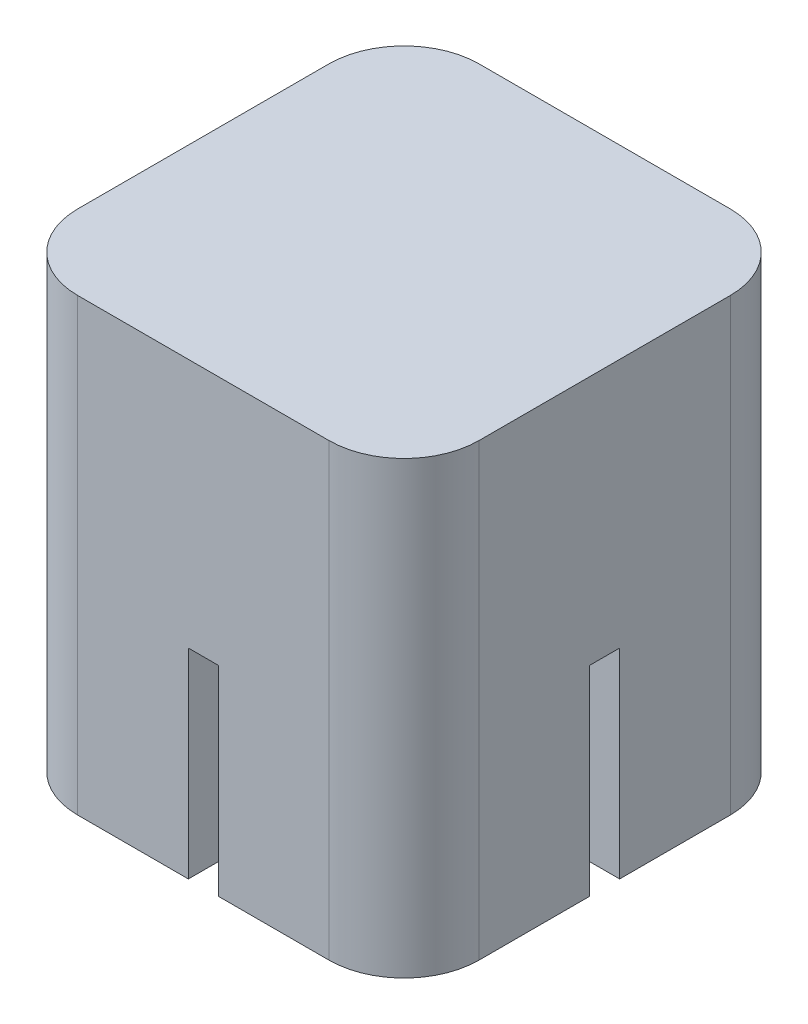
ISO-10303-21;
HEADER;
FILE_DESCRIPTION(('STEP AP214'),'2;1');
FILE_NAME('part.step','',(''),(''),'','','');
FILE_SCHEMA(('AUTOMOTIVE_DESIGN { 1 0 10303 214 1 1 1 1 }'));
ENDSEC;
DATA;
#1=APPLICATION_CONTEXT('core data for automotive mechanical design processes');
#2=APPLICATION_PROTOCOL_DEFINITION('international standard','automotive_design',2000,#1);
#3=PRODUCT_CONTEXT('',#1,'mechanical');
#4=PRODUCT('Part','Part','',(#3));
#5=PRODUCT_RELATED_PRODUCT_CATEGORY('part','',(#4));
#6=PRODUCT_DEFINITION_FORMATION('','',#4);
#7=PRODUCT_DEFINITION_CONTEXT('part definition',#1,'design');
#8=PRODUCT_DEFINITION('design','',#6,#7);
#9=PRODUCT_DEFINITION_SHAPE('','',#8);
#10=(LENGTH_UNIT() NAMED_UNIT(*) SI_UNIT(.MILLI.,.METRE.));
#11=(NAMED_UNIT(*) PLANE_ANGLE_UNIT() SI_UNIT($,.RADIAN.));
#12=(NAMED_UNIT(*) SI_UNIT($,.STERADIAN.) SOLID_ANGLE_UNIT());
#13=UNCERTAINTY_MEASURE_WITH_UNIT(LENGTH_MEASURE(1.E-05),#10,'distance_accuracy_value','');
#14=(GEOMETRIC_REPRESENTATION_CONTEXT(3) GLOBAL_UNCERTAINTY_ASSIGNED_CONTEXT((#13)) GLOBAL_UNIT_ASSIGNED_CONTEXT((#10,
#11,#12)) REPRESENTATION_CONTEXT('',''));
#15=CARTESIAN_POINT('',(0.,0.,0.));
#16=DIRECTION('',(0.,0.,1.));
#17=DIRECTION('',(1.,0.,0.));
#18=AXIS2_PLACEMENT_3D('',#15,#16,#17);
#19=CARTESIAN_POINT('',(0.,8.,0.));
#20=DIRECTION('',(0.,-1.,0.));
#21=DIRECTION('',(0.,0.,-1.));
#22=AXIS2_PLACEMENT_3D('',#19,#20,#21);
#23=CYLINDRICAL_SURFACE('',#22,5.3);
#24=CARTESIAN_POINT('',(0.,0.,0.));
#25=DIRECTION('',(0.,1.,0.));
#26=DIRECTION('',(0.,0.,1.));
#27=AXIS2_PLACEMENT_3D('',#24,#25,#26);
#28=CIRCLE('',#27,5.3);
#29=CARTESIAN_POINT('',(-0.6,0.,-5.26592821827263));
#30=VERTEX_POINT('',#29);
#31=CARTESIAN_POINT('',(-5.26592821827263,0.,-0.6));
#32=VERTEX_POINT('',#31);
#33=EDGE_CURVE('E347',#30,#32,#28,.T.);
#34=ORIENTED_EDGE('',*,*,#33,.F.);
#35=DIRECTION('',(0.,-1.,0.));
#36=VECTOR('',#35,1.);
#37=CARTESIAN_POINT('',(-0.6,8.,-5.26592821827263));
#38=LINE('',#37,#36);
#39=CARTESIAN_POINT('',(-0.6,8.,-5.26592821827263));
#40=VERTEX_POINT('',#39);
#41=EDGE_CURVE('E11',#40,#30,#38,.T.);
#42=ORIENTED_EDGE('',*,*,#41,.F.);
#43=CARTESIAN_POINT('',(0.,8.,0.));
#44=DIRECTION('',(0.,1.,0.));
#45=DIRECTION('',(0.,0.,1.));
#46=AXIS2_PLACEMENT_3D('',#43,#44,#45);
#47=CIRCLE('',#46,5.3);
#48=CARTESIAN_POINT('',(-5.26592821827263,8.,-0.6));
#49=VERTEX_POINT('',#48);
#50=EDGE_CURVE('E348',#40,#49,#47,.T.);
#51=ORIENTED_EDGE('',*,*,#50,.T.);
#52=DIRECTION('',(0.,-1.,0.));
#53=VECTOR('',#52,1.);
#54=CARTESIAN_POINT('',(-5.26592821827263,8.,-0.6));
#55=LINE('',#54,#53);
#56=EDGE_CURVE('E357',#49,#32,#55,.T.);
#57=ORIENTED_EDGE('',*,*,#56,.T.);
#58=EDGE_LOOP('',(#34,#42,#51,#57));
#59=FACE_BOUND('',#58,.T.);
#60=ADVANCED_FACE('F41',(#59),#23,.F.);
#61=CARTESIAN_POINT('',(-0.6,8.,0.));
#62=DIRECTION('',(1.,0.,0.));
#63=DIRECTION('',(0.,0.,-1.));
#64=AXIS2_PLACEMENT_3D('',#61,#62,#63);
#65=PLANE('',#64);
#66=DIRECTION('',(0.,0.,1.));
#67=VECTOR('',#66,1.);
#68=CARTESIAN_POINT('',(-0.6,0.,0.));
#69=LINE('',#68,#67);
#70=CARTESIAN_POINT('',(-0.6,0.,-8.025));
#71=VERTEX_POINT('',#70);
#72=EDGE_CURVE('E360',#71,#30,#69,.T.);
#73=ORIENTED_EDGE('',*,*,#72,.F.);
#74=DIRECTION('',(0.,-1.,0.));
#75=VECTOR('',#74,1.);
#76=CARTESIAN_POINT('',(-0.6,8.,-8.025));
#77=LINE('',#76,#75);
#78=CARTESIAN_POINT('',(-0.6,8.,-8.025));
#79=VERTEX_POINT('',#78);
#80=EDGE_CURVE('E48',#79,#71,#77,.T.);
#81=ORIENTED_EDGE('',*,*,#80,.F.);
#82=DIRECTION('',(0.,0.,1.));
#83=VECTOR('',#82,1.);
#84=CARTESIAN_POINT('',(-0.6,8.,0.));
#85=LINE('',#84,#83);
#86=EDGE_CURVE('E350',#79,#40,#85,.T.);
#87=ORIENTED_EDGE('',*,*,#86,.T.);
#88=ORIENTED_EDGE('',*,*,#41,.T.);
#89=EDGE_LOOP('',(#73,#81,#87,#88));
#90=FACE_BOUND('',#89,.T.);
#91=ADVANCED_FACE('F388',(#90),#65,.T.);
#92=CARTESIAN_POINT('',(0.,8.,-8.025));
#93=DIRECTION('',(0.,0.,-1.));
#94=DIRECTION('',(-1.,0.,0.));
#95=AXIS2_PLACEMENT_3D('',#92,#93,#94);
#96=PLANE('',#95);
#97=DIRECTION('',(1.,0.,0.));
#98=VECTOR('',#97,1.);
#99=CARTESIAN_POINT('',(0.,0.,-8.025));
#100=LINE('',#99,#98);
#101=CARTESIAN_POINT('',(-5.025,0.,-8.025));
#102=VERTEX_POINT('',#101);
#103=EDGE_CURVE('E363',#102,#71,#100,.T.);
#104=ORIENTED_EDGE('',*,*,#103,.F.);
#105=DIRECTION('',(0.,-1.,0.));
#106=VECTOR('',#105,1.);
#107=CARTESIAN_POINT('',(-5.025,8.,-8.025));
#108=LINE('',#107,#106);
#109=CARTESIAN_POINT('',(-5.025,18.,-8.025));
#110=VERTEX_POINT('',#109);
#111=EDGE_CURVE('E379',#110,#102,#108,.T.);
#112=ORIENTED_EDGE('',*,*,#111,.F.);
#113=DIRECTION('',(1.,0.,0.));
#114=VECTOR('',#113,1.);
#115=CARTESIAN_POINT('',(0.,18.,-8.025));
#116=LINE('',#115,#114);
#117=CARTESIAN_POINT('',(5.025,18.,-8.025));
#118=VERTEX_POINT('',#117);
#119=EDGE_CURVE('E315',#110,#118,#116,.T.);
#120=ORIENTED_EDGE('',*,*,#119,.T.);
#121=DIRECTION('',(0.,-1.,0.));
#122=VECTOR('',#121,1.);
#123=CARTESIAN_POINT('',(5.025,18.,-8.025));
#124=LINE('',#123,#122);
#125=CARTESIAN_POINT('',(5.025,0.,-8.025));
#126=VERTEX_POINT('',#125);
#127=EDGE_CURVE('E343',#118,#126,#124,.T.);
#128=ORIENTED_EDGE('',*,*,#127,.T.);
#129=DIRECTION('',(1.,0.,0.));
#130=VECTOR('',#129,1.);
#131=CARTESIAN_POINT('',(0.,0.,-8.025));
#132=LINE('',#131,#130);
#133=CARTESIAN_POINT('',(0.6,0.,-8.025));
#134=VERTEX_POINT('',#133);
#135=EDGE_CURVE('E298',#134,#126,#132,.T.);
#136=ORIENTED_EDGE('',*,*,#135,.F.);
#137=DIRECTION('',(0.,-1.,0.));
#138=VECTOR('',#137,1.);
#139=CARTESIAN_POINT('',(0.6,8.,-8.025));
#140=LINE('',#139,#138);
#141=CARTESIAN_POINT('',(0.6,8.,-8.025));
#142=VERTEX_POINT('',#141);
#143=EDGE_CURVE('E304',#142,#134,#140,.T.);
#144=ORIENTED_EDGE('',*,*,#143,.F.);
#145=DIRECTION('',(1.,0.,0.));
#146=VECTOR('',#145,1.);
#147=CARTESIAN_POINT('',(0.,8.,-8.025));
#148=LINE('',#147,#146);
#149=EDGE_CURVE('E333',#79,#142,#148,.T.);
#150=ORIENTED_EDGE('',*,*,#149,.F.);
#151=ORIENTED_EDGE('',*,*,#80,.T.);
#152=EDGE_LOOP('',(#104,#112,#120,#128,#136,#144,#150,#151));
#153=FACE_BOUND('',#152,.T.);
#154=ADVANCED_FACE('F384',(#153),#96,.T.);
#155=CARTESIAN_POINT('',(-5.025,8.,-5.025));
#156=DIRECTION('',(0.,-1.,0.));
#157=DIRECTION('',(0.,0.,-1.));
#158=AXIS2_PLACEMENT_3D('',#155,#156,#157);
#159=CYLINDRICAL_SURFACE('',#158,3.);
#160=CARTESIAN_POINT('',(-5.025,0.,-5.025));
#161=DIRECTION('',(0.,1.,0.));
#162=DIRECTION('',(0.,0.,1.));
#163=AXIS2_PLACEMENT_3D('',#160,#161,#162);
#164=CIRCLE('',#163,3.);
#165=CARTESIAN_POINT('',(-8.025,0.,-5.025));
#166=VERTEX_POINT('',#165);
#167=EDGE_CURVE('E366',#166,#102,#164,.F.);
#168=ORIENTED_EDGE('',*,*,#167,.F.);
#169=DIRECTION('',(0.,-1.,0.));
#170=VECTOR('',#169,1.);
#171=CARTESIAN_POINT('',(-8.025,8.,-5.025));
#172=LINE('',#171,#170);
#173=CARTESIAN_POINT('',(-8.025,18.,-5.025));
#174=VERTEX_POINT('',#173);
#175=EDGE_CURVE('E377',#174,#166,#172,.T.);
#176=ORIENTED_EDGE('',*,*,#175,.F.);
#177=CARTESIAN_POINT('',(-5.025,18.,-5.025));
#178=DIRECTION('',(0.,1.,0.));
#179=DIRECTION('',(0.,0.,1.));
#180=AXIS2_PLACEMENT_3D('',#177,#178,#179);
#181=CIRCLE('',#180,3.);
#182=EDGE_CURVE('E318',#174,#110,#181,.F.);
#183=ORIENTED_EDGE('',*,*,#182,.T.);
#184=ORIENTED_EDGE('',*,*,#111,.T.);
#185=EDGE_LOOP('',(#168,#176,#183,#184));
#186=FACE_BOUND('',#185,.T.);
#187=ADVANCED_FACE('F396',(#186),#159,.T.);
#188=CARTESIAN_POINT('',(-8.025,8.,0.));
#189=DIRECTION('',(-1.,0.,0.));
#190=DIRECTION('',(0.,0.,1.));
#191=AXIS2_PLACEMENT_3D('',#188,#189,#190);
#192=PLANE('',#191);
#193=DIRECTION('',(0.,0.,-1.));
#194=VECTOR('',#193,1.);
#195=CARTESIAN_POINT('',(-8.025,0.,0.));
#196=LINE('',#195,#194);
#197=CARTESIAN_POINT('',(-8.025,0.,-0.6));
#198=VERTEX_POINT('',#197);
#199=EDGE_CURVE('E369',#198,#166,#196,.T.);
#200=ORIENTED_EDGE('',*,*,#199,.F.);
#201=DIRECTION('',(0.,-1.,0.));
#202=VECTOR('',#201,1.);
#203=CARTESIAN_POINT('',(-8.025,8.,-0.6));
#204=LINE('',#203,#202);
#205=CARTESIAN_POINT('',(-8.025,8.,-0.6));
#206=VERTEX_POINT('',#205);
#207=EDGE_CURVE('E375',#206,#198,#204,.T.);
#208=ORIENTED_EDGE('',*,*,#207,.F.);
#209=DIRECTION('',(0.,0.,-1.));
#210=VECTOR('',#209,1.);
#211=CARTESIAN_POINT('',(-8.025,8.,0.));
#212=LINE('',#211,#210);
#213=CARTESIAN_POINT('',(-8.025,8.,0.6));
#214=VERTEX_POINT('',#213);
#215=EDGE_CURVE('E205',#214,#206,#212,.T.);
#216=ORIENTED_EDGE('',*,*,#215,.F.);
#217=DIRECTION('',(0.,-1.,0.));
#218=VECTOR('',#217,1.);
#219=CARTESIAN_POINT('',(-8.025,8.,0.6));
#220=LINE('',#219,#218);
#221=CARTESIAN_POINT('',(-8.025,0.,0.6));
#222=VERTEX_POINT('',#221);
#223=EDGE_CURVE('E215',#214,#222,#220,.T.);
#224=ORIENTED_EDGE('',*,*,#223,.T.);
#225=DIRECTION('',(0.,0.,-1.));
#226=VECTOR('',#225,1.);
#227=CARTESIAN_POINT('',(-8.025,0.,0.));
#228=LINE('',#227,#226);
#229=CARTESIAN_POINT('',(-8.025,0.,5.025));
#230=VERTEX_POINT('',#229);
#231=EDGE_CURVE('E232',#230,#222,#228,.T.);
#232=ORIENTED_EDGE('',*,*,#231,.F.);
#233=DIRECTION('',(0.,-1.,0.));
#234=VECTOR('',#233,1.);
#235=CARTESIAN_POINT('',(-8.025,18.,5.025));
#236=LINE('',#235,#234);
#237=CARTESIAN_POINT('',(-8.025,18.,5.025));
#238=VERTEX_POINT('',#237);
#239=EDGE_CURVE('E341',#238,#230,#236,.T.);
#240=ORIENTED_EDGE('',*,*,#239,.F.);
#241=DIRECTION('',(0.,0.,-1.));
#242=VECTOR('',#241,1.);
#243=CARTESIAN_POINT('',(-8.025,18.,0.));
#244=LINE('',#243,#242);
#245=EDGE_CURVE('E321',#238,#174,#244,.T.);
#246=ORIENTED_EDGE('',*,*,#245,.T.);
#247=ORIENTED_EDGE('',*,*,#175,.T.);
#248=EDGE_LOOP('',(#200,#208,#216,#224,#232,#240,#246,#247));
#249=FACE_BOUND('',#248,.T.);
#250=ADVANCED_FACE('F428',(#249),#192,.T.);
#251=CARTESIAN_POINT('',(0.,8.,-0.6));
#252=DIRECTION('',(0.,0.,-1.));
#253=DIRECTION('',(-1.,0.,0.));
#254=AXIS2_PLACEMENT_3D('',#251,#252,#253);
#255=PLANE('',#254);
#256=DIRECTION('',(1.,0.,0.));
#257=VECTOR('',#256,1.);
#258=CARTESIAN_POINT('',(0.,0.,-0.6));
#259=LINE('',#258,#257);
#260=EDGE_CURVE('E351',#198,#32,#259,.T.);
#261=ORIENTED_EDGE('',*,*,#260,.T.);
#262=ORIENTED_EDGE('',*,*,#56,.F.);
#263=DIRECTION('',(1.,0.,0.));
#264=VECTOR('',#263,1.);
#265=CARTESIAN_POINT('',(0.,8.,-0.6));
#266=LINE('',#265,#264);
#267=EDGE_CURVE('E354',#206,#49,#266,.T.);
#268=ORIENTED_EDGE('',*,*,#267,.F.);
#269=ORIENTED_EDGE('',*,*,#207,.T.);
#270=EDGE_LOOP('',(#261,#262,#268,#269));
#271=FACE_BOUND('',#270,.T.);
#272=ADVANCED_FACE('F425',(#271),#255,.F.);
#273=CARTESIAN_POINT('',(0.,0.,0.));
#274=DIRECTION('',(0.,1.,0.));
#275=DIRECTION('',(0.,0.,1.));
#276=AXIS2_PLACEMENT_3D('',#273,#274,#275);
#277=PLANE('',#276);
#278=ORIENTED_EDGE('',*,*,#33,.T.);
#279=ORIENTED_EDGE('',*,*,#260,.F.);
#280=ORIENTED_EDGE('',*,*,#199,.T.);
#281=ORIENTED_EDGE('',*,*,#167,.T.);
#282=ORIENTED_EDGE('',*,*,#103,.T.);
#283=ORIENTED_EDGE('',*,*,#72,.T.);
#284=EDGE_LOOP('',(#278,#279,#280,#281,#282,#283));
#285=FACE_BOUND('',#284,.T.);
#286=ADVANCED_FACE('F391',(#285),#277,.F.);
#287=CARTESIAN_POINT('',(8.025,18.,0.));
#288=DIRECTION('',(-1.,0.,0.));
#289=DIRECTION('',(0.,0.,1.));
#290=AXIS2_PLACEMENT_3D('',#287,#288,#289);
#291=PLANE('',#290);
#292=DIRECTION('',(0.,-1.,0.));
#293=VECTOR('',#292,1.);
#294=CARTESIAN_POINT('',(8.025,18.,5.025));
#295=LINE('',#294,#293);
#296=CARTESIAN_POINT('',(8.025,18.,5.025));
#297=VERTEX_POINT('',#296);
#298=CARTESIAN_POINT('',(8.025,0.,5.025));
#299=VERTEX_POINT('',#298);
#300=EDGE_CURVE('E331',#297,#299,#295,.T.);
#301=ORIENTED_EDGE('',*,*,#300,.T.);
#302=DIRECTION('',(0.,0.,-1.));
#303=VECTOR('',#302,1.);
#304=CARTESIAN_POINT('',(8.025,0.,0.));
#305=LINE('',#304,#303);
#306=CARTESIAN_POINT('',(8.025,0.,0.6));
#307=VERTEX_POINT('',#306);
#308=EDGE_CURVE('E264',#299,#307,#305,.T.);
#309=ORIENTED_EDGE('',*,*,#308,.T.);
#310=DIRECTION('',(0.,-1.,0.));
#311=VECTOR('',#310,1.);
#312=CARTESIAN_POINT('',(8.025,8.,0.6));
#313=LINE('',#312,#311);
#314=CARTESIAN_POINT('',(8.025,8.,0.6));
#315=VERTEX_POINT('',#314);
#316=EDGE_CURVE('E269',#315,#307,#313,.T.);
#317=ORIENTED_EDGE('',*,*,#316,.F.);
#318=DIRECTION('',(0.,0.,-1.));
#319=VECTOR('',#318,1.);
#320=CARTESIAN_POINT('',(8.025,8.,0.));
#321=LINE('',#320,#319);
#322=CARTESIAN_POINT('',(8.025,8.,-0.6));
#323=VERTEX_POINT('',#322);
#324=EDGE_CURVE('E310',#315,#323,#321,.T.);
#325=ORIENTED_EDGE('',*,*,#324,.T.);
#326=DIRECTION('',(0.,-1.,0.));
#327=VECTOR('',#326,1.);
#328=CARTESIAN_POINT('',(8.025,8.,-0.6));
#329=LINE('',#328,#327);
#330=CARTESIAN_POINT('',(8.025,0.,-0.6));
#331=VERTEX_POINT('',#330);
#332=EDGE_CURVE('E306',#323,#331,#329,.T.);
#333=ORIENTED_EDGE('',*,*,#332,.T.);
#334=DIRECTION('',(0.,0.,-1.));
#335=VECTOR('',#334,1.);
#336=CARTESIAN_POINT('',(8.025,0.,0.));
#337=LINE('',#336,#335);
#338=CARTESIAN_POINT('',(8.025,0.,-5.025));
#339=VERTEX_POINT('',#338);
#340=EDGE_CURVE('E292',#331,#339,#337,.T.);
#341=ORIENTED_EDGE('',*,*,#340,.T.);
#342=DIRECTION('',(0.,-1.,0.));
#343=VECTOR('',#342,1.);
#344=CARTESIAN_POINT('',(8.025,18.,-5.025));
#345=LINE('',#344,#343);
#346=CARTESIAN_POINT('',(8.025,18.,-5.025));
#347=VERTEX_POINT('',#346);
#348=EDGE_CURVE('E345',#347,#339,#345,.T.);
#349=ORIENTED_EDGE('',*,*,#348,.F.);
#350=DIRECTION('',(0.,0.,-1.));
#351=VECTOR('',#350,1.);
#352=CARTESIAN_POINT('',(8.025,18.,0.));
#353=LINE('',#352,#351);
#354=EDGE_CURVE('E204',#297,#347,#353,.T.);
#355=ORIENTED_EDGE('',*,*,#354,.F.);
#356=EDGE_LOOP('',(#301,#309,#317,#325,#333,#341,#349,#355));
#357=FACE_BOUND('',#356,.T.);
#358=ADVANCED_FACE('F444',(#357),#291,.F.);
#359=CARTESIAN_POINT('',(5.025,18.,-5.025));
#360=DIRECTION('',(0.,-1.,0.));
#361=DIRECTION('',(0.,0.,-1.));
#362=AXIS2_PLACEMENT_3D('',#359,#360,#361);
#363=CYLINDRICAL_SURFACE('',#362,3.);
#364=ORIENTED_EDGE('',*,*,#348,.T.);
#365=CARTESIAN_POINT('',(5.025,0.,-5.025));
#366=DIRECTION('',(0.,1.,0.));
#367=DIRECTION('',(0.,0.,1.));
#368=AXIS2_PLACEMENT_3D('',#365,#366,#367);
#369=CIRCLE('',#368,3.);
#370=EDGE_CURVE('E295',#126,#339,#369,.F.);
#371=ORIENTED_EDGE('',*,*,#370,.F.);
#372=ORIENTED_EDGE('',*,*,#127,.F.);
#373=CARTESIAN_POINT('',(5.025,18.,-5.025));
#374=DIRECTION('',(0.,1.,0.));
#375=DIRECTION('',(0.,0.,1.));
#376=AXIS2_PLACEMENT_3D('',#373,#374,#375);
#377=CIRCLE('',#376,3.);
#378=EDGE_CURVE('E312',#118,#347,#377,.F.);
#379=ORIENTED_EDGE('',*,*,#378,.T.);
#380=EDGE_LOOP('',(#364,#371,#372,#379));
#381=FACE_BOUND('',#380,.T.);
#382=ADVANCED_FACE('F406',(#381),#363,.T.);
#383=CARTESIAN_POINT('',(-5.025,18.,5.025));
#384=DIRECTION('',(0.,-1.,0.));
#385=DIRECTION('',(0.,0.,-1.));
#386=AXIS2_PLACEMENT_3D('',#383,#384,#385);
#387=CYLINDRICAL_SURFACE('',#386,3.);
#388=ORIENTED_EDGE('',*,*,#239,.T.);
#389=CARTESIAN_POINT('',(-5.025,0.,5.025));
#390=DIRECTION('',(0.,1.,0.));
#391=DIRECTION('',(0.,0.,1.));
#392=AXIS2_PLACEMENT_3D('',#389,#390,#391);
#393=CIRCLE('',#392,3.);
#394=CARTESIAN_POINT('',(-5.025,0.,8.025));
#395=VERTEX_POINT('',#394);
#396=EDGE_CURVE('E235',#395,#230,#393,.F.);
#397=ORIENTED_EDGE('',*,*,#396,.F.);
#398=DIRECTION('',(0.,-1.,0.));
#399=VECTOR('',#398,1.);
#400=CARTESIAN_POINT('',(-5.025,18.,8.025));
#401=LINE('',#400,#399);
#402=CARTESIAN_POINT('',(-5.025,18.,8.025));
#403=VERTEX_POINT('',#402);
#404=EDGE_CURVE('E339',#403,#395,#401,.T.);
#405=ORIENTED_EDGE('',*,*,#404,.F.);
#406=CARTESIAN_POINT('',(-5.025,18.,5.025));
#407=DIRECTION('',(0.,1.,0.));
#408=DIRECTION('',(0.,0.,1.));
#409=AXIS2_PLACEMENT_3D('',#406,#407,#408);
#410=CIRCLE('',#409,3.);
#411=EDGE_CURVE('E324',#403,#238,#410,.F.);
#412=ORIENTED_EDGE('',*,*,#411,.T.);
#413=EDGE_LOOP('',(#388,#397,#405,#412));
#414=FACE_BOUND('',#413,.T.);
#415=ADVANCED_FACE('F433',(#414),#387,.T.);
#416=CARTESIAN_POINT('',(0.,18.,8.025));
#417=DIRECTION('',(0.,0.,-1.));
#418=DIRECTION('',(-1.,0.,0.));
#419=AXIS2_PLACEMENT_3D('',#416,#417,#418);
#420=PLANE('',#419);
#421=ORIENTED_EDGE('',*,*,#404,.T.);
#422=DIRECTION('',(1.,0.,0.));
#423=VECTOR('',#422,1.);
#424=CARTESIAN_POINT('',(0.,0.,8.025));
#425=LINE('',#424,#423);
#426=CARTESIAN_POINT('',(-0.6,0.,8.025));
#427=VERTEX_POINT('',#426);
#428=EDGE_CURVE('E211',#395,#427,#425,.T.);
#429=ORIENTED_EDGE('',*,*,#428,.T.);
#430=DIRECTION('',(0.,-1.,0.));
#431=VECTOR('',#430,1.);
#432=CARTESIAN_POINT('',(-0.6,8.,8.025));
#433=LINE('',#432,#431);
#434=CARTESIAN_POINT('',(-0.6,8.,8.025));
#435=VERTEX_POINT('',#434);
#436=EDGE_CURVE('E208',#435,#427,#433,.T.);
#437=ORIENTED_EDGE('',*,*,#436,.F.);
#438=DIRECTION('',(1.,0.,0.));
#439=VECTOR('',#438,1.);
#440=CARTESIAN_POINT('',(0.,8.,8.025));
#441=LINE('',#440,#439);
#442=CARTESIAN_POINT('',(0.6,8.,8.025));
#443=VERTEX_POINT('',#442);
#444=EDGE_CURVE('E197',#435,#443,#441,.T.);
#445=ORIENTED_EDGE('',*,*,#444,.T.);
#446=DIRECTION('',(0.,-1.,0.));
#447=VECTOR('',#446,1.);
#448=CARTESIAN_POINT('',(0.6,8.,8.025));
#449=LINE('',#448,#447);
#450=CARTESIAN_POINT('',(0.6,0.,8.025));
#451=VERTEX_POINT('',#450);
#452=EDGE_CURVE('E272',#443,#451,#449,.T.);
#453=ORIENTED_EDGE('',*,*,#452,.T.);
#454=DIRECTION('',(1.,0.,0.));
#455=VECTOR('',#454,1.);
#456=CARTESIAN_POINT('',(0.,0.,8.025));
#457=LINE('',#456,#455);
#458=CARTESIAN_POINT('',(5.025,0.,8.025));
#459=VERTEX_POINT('',#458);
#460=EDGE_CURVE('E258',#451,#459,#457,.T.);
#461=ORIENTED_EDGE('',*,*,#460,.T.);
#462=DIRECTION('',(0.,-1.,0.));
#463=VECTOR('',#462,1.);
#464=CARTESIAN_POINT('',(5.025,18.,8.025));
#465=LINE('',#464,#463);
#466=CARTESIAN_POINT('',(5.025,18.,8.025));
#467=VERTEX_POINT('',#466);
#468=EDGE_CURVE('E337',#467,#459,#465,.T.);
#469=ORIENTED_EDGE('',*,*,#468,.F.);
#470=DIRECTION('',(1.,0.,0.));
#471=VECTOR('',#470,1.);
#472=CARTESIAN_POINT('',(0.,18.,8.025));
#473=LINE('',#472,#471);
#474=EDGE_CURVE('E327',#403,#467,#473,.T.);
#475=ORIENTED_EDGE('',*,*,#474,.F.);
#476=EDGE_LOOP('',(#421,#429,#437,#445,#453,#461,#469,#475));
#477=FACE_BOUND('',#476,.T.);
#478=ADVANCED_FACE('F209',(#477),#420,.F.);
#479=CARTESIAN_POINT('',(5.025,18.,5.025));
#480=DIRECTION('',(0.,-1.,0.));
#481=DIRECTION('',(0.,0.,-1.));
#482=AXIS2_PLACEMENT_3D('',#479,#480,#481);
#483=CYLINDRICAL_SURFACE('',#482,3.);
#484=ORIENTED_EDGE('',*,*,#468,.T.);
#485=CARTESIAN_POINT('',(5.025,0.,5.025));
#486=DIRECTION('',(0.,1.,0.));
#487=DIRECTION('',(0.,0.,1.));
#488=AXIS2_PLACEMENT_3D('',#485,#486,#487);
#489=CIRCLE('',#488,3.);
#490=EDGE_CURVE('E261',#459,#299,#489,.T.);
#491=ORIENTED_EDGE('',*,*,#490,.T.);
#492=ORIENTED_EDGE('',*,*,#300,.F.);
#493=CARTESIAN_POINT('',(5.025,18.,5.025));
#494=DIRECTION('',(0.,1.,0.));
#495=DIRECTION('',(0.,0.,1.));
#496=AXIS2_PLACEMENT_3D('',#493,#494,#495);
#497=CIRCLE('',#496,3.);
#498=EDGE_CURVE('E329',#467,#297,#497,.T.);
#499=ORIENTED_EDGE('',*,*,#498,.F.);
#500=EDGE_LOOP('',(#484,#491,#492,#499));
#501=FACE_BOUND('',#500,.T.);
#502=ADVANCED_FACE('F440',(#501),#483,.T.);
#503=CARTESIAN_POINT('',(0.,18.,0.));
#504=DIRECTION('',(0.,1.,0.));
#505=DIRECTION('',(0.,0.,1.));
#506=AXIS2_PLACEMENT_3D('',#503,#504,#505);
#507=PLANE('',#506);
#508=ORIENTED_EDGE('',*,*,#354,.T.);
#509=ORIENTED_EDGE('',*,*,#378,.F.);
#510=ORIENTED_EDGE('',*,*,#119,.F.);
#511=ORIENTED_EDGE('',*,*,#182,.F.);
#512=ORIENTED_EDGE('',*,*,#245,.F.);
#513=ORIENTED_EDGE('',*,*,#411,.F.);
#514=ORIENTED_EDGE('',*,*,#474,.T.);
#515=ORIENTED_EDGE('',*,*,#498,.T.);
#516=EDGE_LOOP('',(#508,#509,#510,#511,#512,#513,#514,#515));
#517=FACE_BOUND('',#516,.T.);
#518=ADVANCED_FACE('F401',(#517),#507,.T.);
#519=CARTESIAN_POINT('',(0.,8.,0.));
#520=DIRECTION('',(0.,1.,0.));
#521=DIRECTION('',(0.,0.,1.));
#522=AXIS2_PLACEMENT_3D('',#519,#520,#521);
#523=PLANE('',#522);
#524=CARTESIAN_POINT('',(0.,8.,0.));
#525=DIRECTION('',(0.,1.,0.));
#526=DIRECTION('',(0.,0.,1.));
#527=AXIS2_PLACEMENT_3D('',#524,#525,#526);
#528=CIRCLE('',#527,5.3);
#529=CARTESIAN_POINT('',(-5.26592821827263,8.,0.6));
#530=VERTEX_POINT('',#529);
#531=CARTESIAN_POINT('',(-0.6,8.,5.26592821827263));
#532=VERTEX_POINT('',#531);
#533=EDGE_CURVE('E55',#530,#532,#528,.T.);
#534=ORIENTED_EDGE('',*,*,#533,.F.);
#535=DIRECTION('',(1.,0.,0.));
#536=VECTOR('',#535,1.);
#537=CARTESIAN_POINT('',(0.,8.,0.6));
#538=LINE('',#537,#536);
#539=EDGE_CURVE('E219',#214,#530,#538,.T.);
#540=ORIENTED_EDGE('',*,*,#539,.F.);
#541=ORIENTED_EDGE('',*,*,#215,.T.);
#542=ORIENTED_EDGE('',*,*,#267,.T.);
#543=ORIENTED_EDGE('',*,*,#50,.F.);
#544=ORIENTED_EDGE('',*,*,#86,.F.);
#545=ORIENTED_EDGE('',*,*,#149,.T.);
#546=DIRECTION('',(0.,0.,1.));
#547=VECTOR('',#546,1.);
#548=CARTESIAN_POINT('',(0.6,8.,0.));
#549=LINE('',#548,#547);
#550=CARTESIAN_POINT('',(0.6,8.,-5.26592821827263));
#551=VERTEX_POINT('',#550);
#552=EDGE_CURVE('E284',#142,#551,#549,.T.);
#553=ORIENTED_EDGE('',*,*,#552,.T.);
#554=CARTESIAN_POINT('',(0.,8.,0.));
#555=DIRECTION('',(0.,1.,0.));
#556=DIRECTION('',(0.,0.,1.));
#557=AXIS2_PLACEMENT_3D('',#554,#555,#556);
#558=CIRCLE('',#557,5.3);
#559=CARTESIAN_POINT('',(5.26592821827263,8.,-0.6));
#560=VERTEX_POINT('',#559);
#561=EDGE_CURVE('E277',#560,#551,#558,.T.);
#562=ORIENTED_EDGE('',*,*,#561,.F.);
#563=DIRECTION('',(-1.,0.,0.));
#564=VECTOR('',#563,1.);
#565=CARTESIAN_POINT('',(0.,8.,-0.6));
#566=LINE('',#565,#564);
#567=EDGE_CURVE('E280',#323,#560,#566,.T.);
#568=ORIENTED_EDGE('',*,*,#567,.F.);
#569=ORIENTED_EDGE('',*,*,#324,.F.);
#570=DIRECTION('',(-1.,0.,0.));
#571=VECTOR('',#570,1.);
#572=CARTESIAN_POINT('',(0.,8.,0.6));
#573=LINE('',#572,#571);
#574=CARTESIAN_POINT('',(5.26592821827263,8.,0.6));
#575=VERTEX_POINT('',#574);
#576=EDGE_CURVE('E250',#315,#575,#573,.T.);
#577=ORIENTED_EDGE('',*,*,#576,.T.);
#578=CARTESIAN_POINT('',(0.,8.,0.));
#579=DIRECTION('',(0.,1.,0.));
#580=DIRECTION('',(0.,0.,1.));
#581=AXIS2_PLACEMENT_3D('',#578,#579,#580);
#582=CIRCLE('',#581,5.3);
#583=CARTESIAN_POINT('',(0.6,8.,5.26592821827263));
#584=VERTEX_POINT('',#583);
#585=EDGE_CURVE('E245',#584,#575,#582,.T.);
#586=ORIENTED_EDGE('',*,*,#585,.F.);
#587=DIRECTION('',(0.,0.,-1.));
#588=VECTOR('',#587,1.);
#589=CARTESIAN_POINT('',(0.6,8.,0.));
#590=LINE('',#589,#588);
#591=EDGE_CURVE('E201',#443,#584,#590,.T.);
#592=ORIENTED_EDGE('',*,*,#591,.F.);
#593=ORIENTED_EDGE('',*,*,#444,.F.);
#594=DIRECTION('',(0.,0.,-1.));
#595=VECTOR('',#594,1.);
#596=CARTESIAN_POINT('',(-0.6,8.,0.));
#597=LINE('',#596,#595);
#598=EDGE_CURVE('E60',#435,#532,#597,.T.);
#599=ORIENTED_EDGE('',*,*,#598,.T.);
#600=EDGE_LOOP('',(#534,#540,#541,#542,#543,#544,#545,#553,#562,#568,#569,#577,#586,#592,#593,#599));
#601=FACE_BOUND('',#600,.T.);
#602=ADVANCED_FACE('F199',(#601),#523,.F.);
#603=CARTESIAN_POINT('',(0.,8.,0.));
#604=DIRECTION('',(0.,-1.,0.));
#605=DIRECTION('',(0.,0.,-1.));
#606=AXIS2_PLACEMENT_3D('',#603,#604,#605);
#607=CYLINDRICAL_SURFACE('',#606,5.3);
#608=CARTESIAN_POINT('',(0.,0.,0.));
#609=DIRECTION('',(0.,1.,0.));
#610=DIRECTION('',(0.,0.,1.));
#611=AXIS2_PLACEMENT_3D('',#608,#609,#610);
#612=CIRCLE('',#611,5.3);
#613=CARTESIAN_POINT('',(5.26592821827263,0.,-0.6));
#614=VERTEX_POINT('',#613);
#615=CARTESIAN_POINT('',(0.6,0.,-5.26592821827263));
#616=VERTEX_POINT('',#615);
#617=EDGE_CURVE('E276',#614,#616,#612,.T.);
#618=ORIENTED_EDGE('',*,*,#617,.F.);
#619=DIRECTION('',(0.,-1.,0.));
#620=VECTOR('',#619,1.);
#621=CARTESIAN_POINT('',(5.26592821827263,8.,-0.6));
#622=LINE('',#621,#620);
#623=EDGE_CURVE('E308',#560,#614,#622,.T.);
#624=ORIENTED_EDGE('',*,*,#623,.F.);
#625=ORIENTED_EDGE('',*,*,#561,.T.);
#626=DIRECTION('',(0.,-1.,0.));
#627=VECTOR('',#626,1.);
#628=CARTESIAN_POINT('',(0.6,8.,-5.26592821827263));
#629=LINE('',#628,#627);
#630=EDGE_CURVE('E286',#551,#616,#629,.T.);
#631=ORIENTED_EDGE('',*,*,#630,.T.);
#632=EDGE_LOOP('',(#618,#624,#625,#631));
#633=FACE_BOUND('',#632,.T.);
#634=ADVANCED_FACE('F450',(#633),#607,.F.);
#635=CARTESIAN_POINT('',(0.,8.,-0.6));
#636=DIRECTION('',(0.,0.,1.));
#637=DIRECTION('',(1.,0.,0.));
#638=AXIS2_PLACEMENT_3D('',#635,#636,#637);
#639=PLANE('',#638);
#640=DIRECTION('',(-1.,0.,0.));
#641=VECTOR('',#640,1.);
#642=CARTESIAN_POINT('',(0.,0.,-0.6));
#643=LINE('',#642,#641);
#644=EDGE_CURVE('E289',#331,#614,#643,.T.);
#645=ORIENTED_EDGE('',*,*,#644,.F.);
#646=ORIENTED_EDGE('',*,*,#332,.F.);
#647=ORIENTED_EDGE('',*,*,#567,.T.);
#648=ORIENTED_EDGE('',*,*,#623,.T.);
#649=EDGE_LOOP('',(#645,#646,#647,#648));
#650=FACE_BOUND('',#649,.T.);
#651=ADVANCED_FACE('F448',(#650),#639,.T.);
#652=CARTESIAN_POINT('',(0.6,8.,0.));
#653=DIRECTION('',(1.,0.,0.));
#654=DIRECTION('',(0.,0.,-1.));
#655=AXIS2_PLACEMENT_3D('',#652,#653,#654);
#656=PLANE('',#655);
#657=DIRECTION('',(0.,0.,1.));
#658=VECTOR('',#657,1.);
#659=CARTESIAN_POINT('',(0.6,0.,0.));
#660=LINE('',#659,#658);
#661=EDGE_CURVE('E281',#134,#616,#660,.T.);
#662=ORIENTED_EDGE('',*,*,#661,.T.);
#663=ORIENTED_EDGE('',*,*,#630,.F.);
#664=ORIENTED_EDGE('',*,*,#552,.F.);
#665=ORIENTED_EDGE('',*,*,#143,.T.);
#666=EDGE_LOOP('',(#662,#663,#664,#665));
#667=FACE_BOUND('',#666,.T.);
#668=ADVANCED_FACE('F417',(#667),#656,.F.);
#669=CARTESIAN_POINT('',(0.,0.,0.));
#670=DIRECTION('',(0.,1.,0.));
#671=DIRECTION('',(0.,0.,1.));
#672=AXIS2_PLACEMENT_3D('',#669,#670,#671);
#673=PLANE('',#672);
#674=ORIENTED_EDGE('',*,*,#617,.T.);
#675=ORIENTED_EDGE('',*,*,#661,.F.);
#676=ORIENTED_EDGE('',*,*,#135,.T.);
#677=ORIENTED_EDGE('',*,*,#370,.T.);
#678=ORIENTED_EDGE('',*,*,#340,.F.);
#679=ORIENTED_EDGE('',*,*,#644,.T.);
#680=EDGE_LOOP('',(#674,#675,#676,#677,#678,#679));
#681=FACE_BOUND('',#680,.T.);
#682=ADVANCED_FACE('F412',(#681),#673,.F.);
#683=CARTESIAN_POINT('',(0.,8.,0.));
#684=DIRECTION('',(0.,-1.,0.));
#685=DIRECTION('',(0.,0.,-1.));
#686=AXIS2_PLACEMENT_3D('',#683,#684,#685);
#687=CYLINDRICAL_SURFACE('',#686,5.3);
#688=CARTESIAN_POINT('',(0.,0.,0.));
#689=DIRECTION('',(0.,1.,0.));
#690=DIRECTION('',(0.,0.,1.));
#691=AXIS2_PLACEMENT_3D('',#688,#689,#690);
#692=CIRCLE('',#691,5.3);
#693=CARTESIAN_POINT('',(0.6,0.,5.26592821827263));
#694=VERTEX_POINT('',#693);
#695=CARTESIAN_POINT('',(5.26592821827263,0.,0.6));
#696=VERTEX_POINT('',#695);
#697=EDGE_CURVE('E244',#694,#696,#692,.T.);
#698=ORIENTED_EDGE('',*,*,#697,.F.);
#699=DIRECTION('',(0.,-1.,0.));
#700=VECTOR('',#699,1.);
#701=CARTESIAN_POINT('',(0.6,8.,5.26592821827263));
#702=LINE('',#701,#700);
#703=EDGE_CURVE('E274',#584,#694,#702,.T.);
#704=ORIENTED_EDGE('',*,*,#703,.F.);
#705=ORIENTED_EDGE('',*,*,#585,.T.);
#706=DIRECTION('',(0.,-1.,0.));
#707=VECTOR('',#706,1.);
#708=CARTESIAN_POINT('',(5.26592821827263,8.,0.6));
#709=LINE('',#708,#707);
#710=EDGE_CURVE('E252',#575,#696,#709,.T.);
#711=ORIENTED_EDGE('',*,*,#710,.T.);
#712=EDGE_LOOP('',(#698,#704,#705,#711));
#713=FACE_BOUND('',#712,.T.);
#714=ADVANCED_FACE('F524',(#713),#687,.F.);
#715=CARTESIAN_POINT('',(0.6,8.,0.));
#716=DIRECTION('',(-1.,0.,0.));
#717=DIRECTION('',(0.,0.,1.));
#718=AXIS2_PLACEMENT_3D('',#715,#716,#717);
#719=PLANE('',#718);
#720=DIRECTION('',(0.,0.,-1.));
#721=VECTOR('',#720,1.);
#722=CARTESIAN_POINT('',(0.6,0.,0.));
#723=LINE('',#722,#721);
#724=EDGE_CURVE('E255',#451,#694,#723,.T.);
#725=ORIENTED_EDGE('',*,*,#724,.F.);
#726=ORIENTED_EDGE('',*,*,#452,.F.);
#727=ORIENTED_EDGE('',*,*,#591,.T.);
#728=ORIENTED_EDGE('',*,*,#703,.T.);
#729=EDGE_LOOP('',(#725,#726,#727,#728));
#730=FACE_BOUND('',#729,.T.);
#731=ADVANCED_FACE('F534',(#730),#719,.T.);
#732=CARTESIAN_POINT('',(0.,8.,0.6));
#733=DIRECTION('',(0.,0.,1.));
#734=DIRECTION('',(1.,0.,0.));
#735=AXIS2_PLACEMENT_3D('',#732,#733,#734);
#736=PLANE('',#735);
#737=DIRECTION('',(-1.,0.,0.));
#738=VECTOR('',#737,1.);
#739=CARTESIAN_POINT('',(0.,0.,0.6));
#740=LINE('',#739,#738);
#741=EDGE_CURVE('E248',#307,#696,#740,.T.);
#742=ORIENTED_EDGE('',*,*,#741,.T.);
#743=ORIENTED_EDGE('',*,*,#710,.F.);
#744=ORIENTED_EDGE('',*,*,#576,.F.);
#745=ORIENTED_EDGE('',*,*,#316,.T.);
#746=EDGE_LOOP('',(#742,#743,#744,#745));
#747=FACE_BOUND('',#746,.T.);
#748=ADVANCED_FACE('F545',(#747),#736,.F.);
#749=CARTESIAN_POINT('',(0.,0.,0.));
#750=DIRECTION('',(0.,1.,0.));
#751=DIRECTION('',(0.,0.,1.));
#752=AXIS2_PLACEMENT_3D('',#749,#750,#751);
#753=PLANE('',#752);
#754=ORIENTED_EDGE('',*,*,#697,.T.);
#755=ORIENTED_EDGE('',*,*,#741,.F.);
#756=ORIENTED_EDGE('',*,*,#308,.F.);
#757=ORIENTED_EDGE('',*,*,#490,.F.);
#758=ORIENTED_EDGE('',*,*,#460,.F.);
#759=ORIENTED_EDGE('',*,*,#724,.T.);
#760=EDGE_LOOP('',(#754,#755,#756,#757,#758,#759));
#761=FACE_BOUND('',#760,.T.);
#762=ADVANCED_FACE('F555',(#761),#753,.F.);
#763=CARTESIAN_POINT('',(0.,8.,0.));
#764=DIRECTION('',(0.,-1.,0.));
#765=DIRECTION('',(0.,0.,-1.));
#766=AXIS2_PLACEMENT_3D('',#763,#764,#765);
#767=CYLINDRICAL_SURFACE('',#766,5.3);
#768=CARTESIAN_POINT('',(0.,0.,0.));
#769=DIRECTION('',(0.,1.,0.));
#770=DIRECTION('',(0.,0.,1.));
#771=AXIS2_PLACEMENT_3D('',#768,#769,#770);
#772=CIRCLE('',#771,5.3);
#773=CARTESIAN_POINT('',(-5.26592821827263,0.,0.6));
#774=VERTEX_POINT('',#773);
#775=CARTESIAN_POINT('',(-0.6,0.,5.26592821827263));
#776=VERTEX_POINT('',#775);
#777=EDGE_CURVE('E226',#774,#776,#772,.T.);
#778=ORIENTED_EDGE('',*,*,#777,.F.);
#779=DIRECTION('',(0.,-1.,0.));
#780=VECTOR('',#779,1.);
#781=CARTESIAN_POINT('',(-5.26592821827263,8.,0.6));
#782=LINE('',#781,#780);
#783=EDGE_CURVE('E242',#530,#774,#782,.T.);
#784=ORIENTED_EDGE('',*,*,#783,.F.);
#785=ORIENTED_EDGE('',*,*,#533,.T.);
#786=DIRECTION('',(0.,-1.,0.));
#787=VECTOR('',#786,1.);
#788=CARTESIAN_POINT('',(-0.6,8.,5.26592821827263));
#789=LINE('',#788,#787);
#790=EDGE_CURVE('E216',#532,#776,#789,.T.);
#791=ORIENTED_EDGE('',*,*,#790,.T.);
#792=EDGE_LOOP('',(#778,#784,#785,#791));
#793=FACE_BOUND('',#792,.T.);
#794=ADVANCED_FACE('F565',(#793),#767,.F.);
#795=CARTESIAN_POINT('',(0.,8.,0.6));
#796=DIRECTION('',(0.,0.,-1.));
#797=DIRECTION('',(-1.,0.,0.));
#798=AXIS2_PLACEMENT_3D('',#795,#796,#797);
#799=PLANE('',#798);
#800=DIRECTION('',(1.,0.,0.));
#801=VECTOR('',#800,1.);
#802=CARTESIAN_POINT('',(0.,0.,0.6));
#803=LINE('',#802,#801);
#804=EDGE_CURVE('E229',#222,#774,#803,.T.);
#805=ORIENTED_EDGE('',*,*,#804,.F.);
#806=ORIENTED_EDGE('',*,*,#223,.F.);
#807=ORIENTED_EDGE('',*,*,#539,.T.);
#808=ORIENTED_EDGE('',*,*,#783,.T.);
#809=EDGE_LOOP('',(#805,#806,#807,#808));
#810=FACE_BOUND('',#809,.T.);
#811=ADVANCED_FACE('F576',(#810),#799,.T.);
#812=CARTESIAN_POINT('',(-0.6,8.,0.));
#813=DIRECTION('',(-1.,0.,0.));
#814=DIRECTION('',(0.,0.,1.));
#815=AXIS2_PLACEMENT_3D('',#812,#813,#814);
#816=PLANE('',#815);
#817=DIRECTION('',(0.,0.,-1.));
#818=VECTOR('',#817,1.);
#819=CARTESIAN_POINT('',(-0.6,0.,0.));
#820=LINE('',#819,#818);
#821=EDGE_CURVE('E239',#427,#776,#820,.T.);
#822=ORIENTED_EDGE('',*,*,#821,.T.);
#823=ORIENTED_EDGE('',*,*,#790,.F.);
#824=ORIENTED_EDGE('',*,*,#598,.F.);
#825=ORIENTED_EDGE('',*,*,#436,.T.);
#826=EDGE_LOOP('',(#822,#823,#824,#825));
#827=FACE_BOUND('',#826,.T.);
#828=ADVANCED_FACE('F218',(#827),#816,.F.);
#829=CARTESIAN_POINT('',(0.,0.,0.));
#830=DIRECTION('',(0.,1.,0.));
#831=DIRECTION('',(0.,0.,1.));
#832=AXIS2_PLACEMENT_3D('',#829,#830,#831);
#833=PLANE('',#832);
#834=ORIENTED_EDGE('',*,*,#777,.T.);
#835=ORIENTED_EDGE('',*,*,#821,.F.);
#836=ORIENTED_EDGE('',*,*,#428,.F.);
#837=ORIENTED_EDGE('',*,*,#396,.T.);
#838=ORIENTED_EDGE('',*,*,#231,.T.);
#839=ORIENTED_EDGE('',*,*,#804,.T.);
#840=EDGE_LOOP('',(#834,#835,#836,#837,#838,#839));
#841=FACE_BOUND('',#840,.T.);
#842=ADVANCED_FACE('F596',(#841),#833,.F.);
#843=CLOSED_SHELL('',(#60,#91,#154,#187,#250,#272,#286,#358,#382,#415,#478,#502,#518,#602,#634,
#651,#668,#682,#714,#731,#748,#762,#794,#811,#828,#842));
#844=MANIFOLD_SOLID_BREP('B2',#843);
#845=ADVANCED_BREP_SHAPE_REPRESENTATION('',(#18,#844),#14);
#846=SHAPE_DEFINITION_REPRESENTATION(#9,#845);
ENDSEC;
END-ISO-10303-21;
